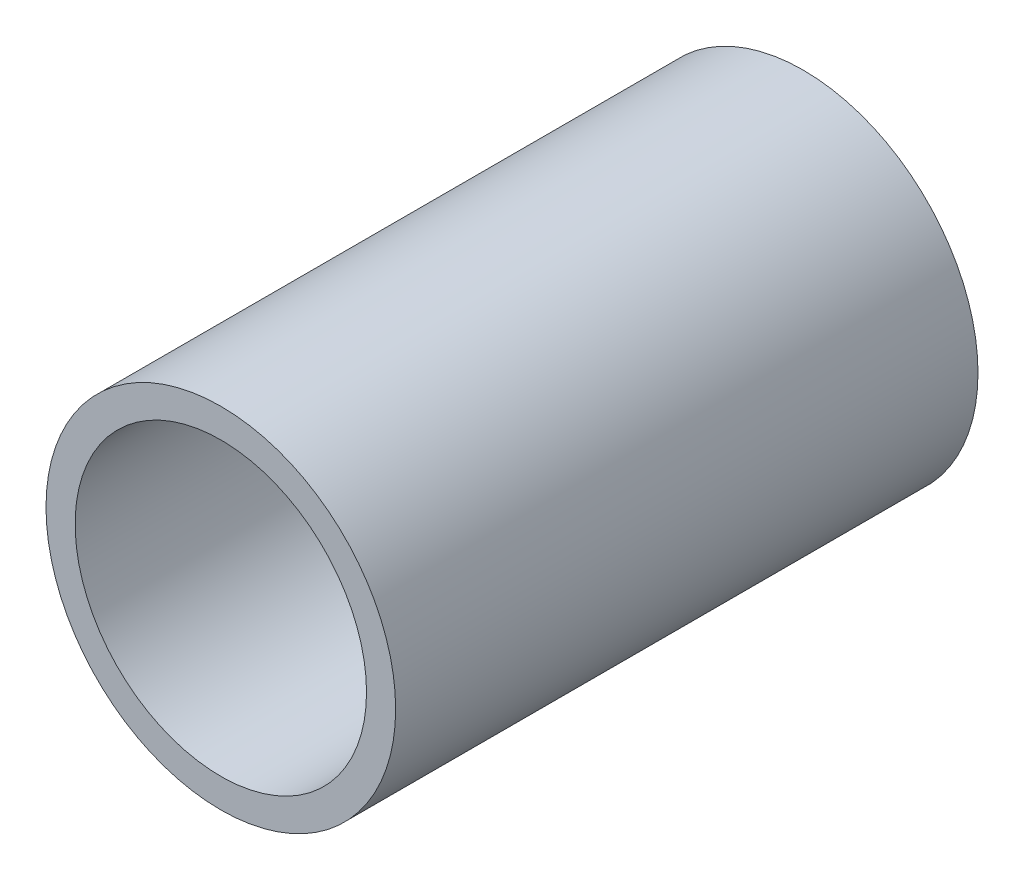
ISO-10303-21;
HEADER;
FILE_DESCRIPTION(('STEP AP214'),'2;1');
FILE_NAME('part.step','',(''),(''),'','','');
FILE_SCHEMA(('AUTOMOTIVE_DESIGN { 1 0 10303 214 1 1 1 1 }'));
ENDSEC;
DATA;
#1=APPLICATION_CONTEXT('core data for automotive mechanical design processes');
#2=APPLICATION_PROTOCOL_DEFINITION('international standard','automotive_design',2000,#1);
#3=PRODUCT_CONTEXT('',#1,'mechanical');
#4=PRODUCT('Part','Part','',(#3));
#5=PRODUCT_RELATED_PRODUCT_CATEGORY('part','',(#4));
#6=PRODUCT_DEFINITION_FORMATION('','',#4);
#7=PRODUCT_DEFINITION_CONTEXT('part definition',#1,'design');
#8=PRODUCT_DEFINITION('design','',#6,#7);
#9=PRODUCT_DEFINITION_SHAPE('','',#8);
#10=(LENGTH_UNIT() NAMED_UNIT(*) SI_UNIT(.MILLI.,.METRE.));
#11=(NAMED_UNIT(*) PLANE_ANGLE_UNIT() SI_UNIT($,.RADIAN.));
#12=(NAMED_UNIT(*) SI_UNIT($,.STERADIAN.) SOLID_ANGLE_UNIT());
#13=UNCERTAINTY_MEASURE_WITH_UNIT(LENGTH_MEASURE(1.E-05),#10,'distance_accuracy_value','');
#14=(GEOMETRIC_REPRESENTATION_CONTEXT(3) GLOBAL_UNCERTAINTY_ASSIGNED_CONTEXT((#13)) GLOBAL_UNIT_ASSIGNED_CONTEXT((#10,
#11,#12)) REPRESENTATION_CONTEXT('',''));
#15=CARTESIAN_POINT('',(0.,0.,0.));
#16=DIRECTION('',(0.,0.,1.));
#17=DIRECTION('',(1.,0.,0.));
#18=AXIS2_PLACEMENT_3D('',#15,#16,#17);
#19=CARTESIAN_POINT('',(0.,0.,31.75));
#20=DIRECTION('',(0.,0.,1.));
#21=DIRECTION('',(1.,0.,0.));
#22=AXIS2_PLACEMENT_3D('',#19,#20,#21);
#23=PLANE('',#22);
#24=CARTESIAN_POINT('',(0.,0.,31.75));
#25=DIRECTION('',(0.,0.,1.));
#26=DIRECTION('',(1.,0.,0.));
#27=AXIS2_PLACEMENT_3D('',#24,#25,#26);
#28=CIRCLE('',#27,19.0627);
#29=CARTESIAN_POINT('',(19.0627,0.,31.75));
#30=VERTEX_POINT('',#29);
#31=EDGE_CURVE('E10',#30,#30,#28,.T.);
#32=ORIENTED_EDGE('',*,*,#31,.T.);
#33=EDGE_LOOP('',(#32));
#34=FACE_BOUND('',#33,.T.);
#35=CARTESIAN_POINT('',(0.,0.,31.75));
#36=DIRECTION('',(0.,0.,1.));
#37=DIRECTION('',(1.,0.,0.));
#38=AXIS2_PLACEMENT_3D('',#35,#36,#37);
#39=CIRCLE('',#38,15.8877);
#40=CARTESIAN_POINT('',(15.8877,0.,31.75));
#41=VERTEX_POINT('',#40);
#42=EDGE_CURVE('E43',#41,#41,#39,.T.);
#43=ORIENTED_EDGE('',*,*,#42,.F.);
#44=EDGE_LOOP('',(#43));
#45=FACE_BOUND('',#44,.T.);
#46=ADVANCED_FACE('F32',(#34,#45),#23,.T.);
#47=CARTESIAN_POINT('',(0.,0.,-31.75));
#48=DIRECTION('',(0.,0.,1.));
#49=DIRECTION('',(1.,0.,0.));
#50=AXIS2_PLACEMENT_3D('',#47,#48,#49);
#51=PLANE('',#50);
#52=CARTESIAN_POINT('',(0.,0.,-31.75));
#53=DIRECTION('',(0.,0.,1.));
#54=DIRECTION('',(1.,0.,0.));
#55=AXIS2_PLACEMENT_3D('',#52,#53,#54);
#56=CIRCLE('',#55,19.0627);
#57=CARTESIAN_POINT('',(19.0627,0.,-31.75));
#58=VERTEX_POINT('',#57);
#59=EDGE_CURVE('E36',#58,#58,#56,.T.);
#60=ORIENTED_EDGE('',*,*,#59,.F.);
#61=EDGE_LOOP('',(#60));
#62=FACE_BOUND('',#61,.T.);
#63=CARTESIAN_POINT('',(0.,0.,-31.75));
#64=DIRECTION('',(0.,0.,1.));
#65=DIRECTION('',(1.,0.,0.));
#66=AXIS2_PLACEMENT_3D('',#63,#64,#65);
#67=CIRCLE('',#66,15.8877);
#68=CARTESIAN_POINT('',(15.8877,0.,-31.75));
#69=VERTEX_POINT('',#68);
#70=EDGE_CURVE('E45',#69,#69,#67,.T.);
#71=ORIENTED_EDGE('',*,*,#70,.T.);
#72=EDGE_LOOP('',(#71));
#73=FACE_BOUND('',#72,.T.);
#74=ADVANCED_FACE('F55',(#62,#73),#51,.F.);
#75=CARTESIAN_POINT('',(0.,0.,31.75));
#76=DIRECTION('',(0.,0.,-1.));
#77=DIRECTION('',(-1.,0.,0.));
#78=AXIS2_PLACEMENT_3D('',#75,#76,#77);
#79=CYLINDRICAL_SURFACE('',#78,19.0627);
#80=ORIENTED_EDGE('',*,*,#31,.F.);
#81=EDGE_LOOP('',(#80));
#82=FACE_BOUND('',#81,.T.);
#83=ORIENTED_EDGE('',*,*,#59,.T.);
#84=EDGE_LOOP('',(#83));
#85=FACE_BOUND('',#84,.T.);
#86=ADVANCED_FACE('F34',(#82,#85),#79,.T.);
#87=CARTESIAN_POINT('',(0.,0.,31.75));
#88=DIRECTION('',(0.,0.,-1.));
#89=DIRECTION('',(-1.,0.,0.));
#90=AXIS2_PLACEMENT_3D('',#87,#88,#89);
#91=CYLINDRICAL_SURFACE('',#90,15.8877);
#92=ORIENTED_EDGE('',*,*,#42,.T.);
#93=EDGE_LOOP('',(#92));
#94=FACE_BOUND('',#93,.T.);
#95=ORIENTED_EDGE('',*,*,#70,.F.);
#96=EDGE_LOOP('',(#95));
#97=FACE_BOUND('',#96,.T.);
#98=ADVANCED_FACE('F51',(#94,#97),#91,.F.);
#99=CLOSED_SHELL('',(#46,#74,#86,#98));
#100=MANIFOLD_SOLID_BREP('B2',#99);
#101=ADVANCED_BREP_SHAPE_REPRESENTATION('',(#18,#100),#14);
#102=SHAPE_DEFINITION_REPRESENTATION(#9,#101);
ENDSEC;
END-ISO-10303-21;
